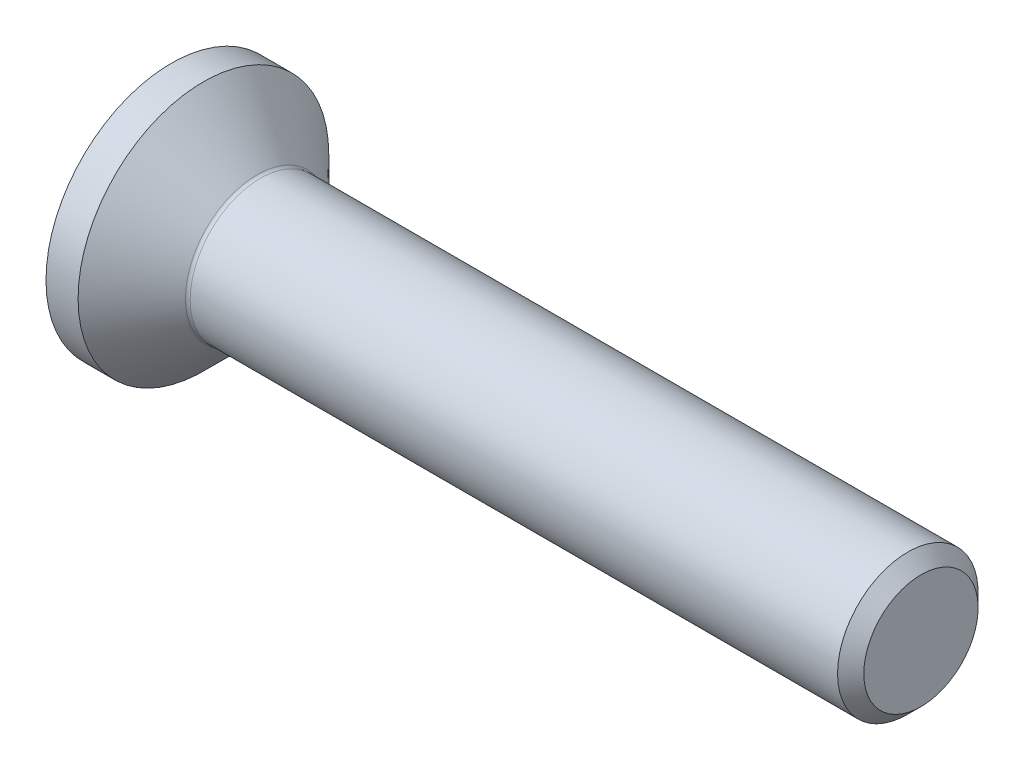
ISO-10303-21;
HEADER;
FILE_DESCRIPTION(('STEP AP214'),'2;1');
FILE_NAME('part.step','',(''),(''),'','','');
FILE_SCHEMA(('AUTOMOTIVE_DESIGN { 1 0 10303 214 1 1 1 1 }'));
ENDSEC;
DATA;
#1=APPLICATION_CONTEXT('core data for automotive mechanical design processes');
#2=APPLICATION_PROTOCOL_DEFINITION('international standard','automotive_design',2000,#1);
#3=PRODUCT_CONTEXT('',#1,'mechanical');
#4=PRODUCT('Part','Part','',(#3));
#5=PRODUCT_RELATED_PRODUCT_CATEGORY('part','',(#4));
#6=PRODUCT_DEFINITION_FORMATION('','',#4);
#7=PRODUCT_DEFINITION_CONTEXT('part definition',#1,'design');
#8=PRODUCT_DEFINITION('design','',#6,#7);
#9=PRODUCT_DEFINITION_SHAPE('','',#8);
#10=(LENGTH_UNIT() NAMED_UNIT(*) SI_UNIT(.MILLI.,.METRE.));
#11=(NAMED_UNIT(*) PLANE_ANGLE_UNIT() SI_UNIT($,.RADIAN.));
#12=(NAMED_UNIT(*) SI_UNIT($,.STERADIAN.) SOLID_ANGLE_UNIT());
#13=UNCERTAINTY_MEASURE_WITH_UNIT(LENGTH_MEASURE(1.E-05),#10,'distance_accuracy_value','');
#14=(GEOMETRIC_REPRESENTATION_CONTEXT(3) GLOBAL_UNCERTAINTY_ASSIGNED_CONTEXT((#13)) GLOBAL_UNIT_ASSIGNED_CONTEXT((#10,
#11,#12)) REPRESENTATION_CONTEXT('',''));
#15=CARTESIAN_POINT('',(0.,0.,0.));
#16=DIRECTION('',(0.,0.,1.));
#17=DIRECTION('',(1.,0.,0.));
#18=AXIS2_PLACEMENT_3D('',#15,#16,#17);
#19=CARTESIAN_POINT('',(0.,0.,0.));
#20=DIRECTION('',(-1.,0.,0.));
#21=DIRECTION('',(0.,0.,1.));
#22=AXIS2_PLACEMENT_3D('',#19,#20,#21);
#23=PLANE('',#22);
#24=CARTESIAN_POINT('',(0.,0.,0.));
#25=DIRECTION('',(-1.,0.,0.));
#26=DIRECTION('',(0.,0.,1.));
#27=AXIS2_PLACEMENT_3D('',#24,#25,#26);
#28=CIRCLE('',#27,2.675);
#29=CARTESIAN_POINT('',(0.,0.,2.675));
#30=VERTEX_POINT('',#29);
#31=EDGE_CURVE('E153',#30,#30,#28,.T.);
#32=ORIENTED_EDGE('',*,*,#31,.T.);
#33=EDGE_LOOP('',(#32));
#34=FACE_BOUND('',#33,.T.);
#35=DIRECTION('',(0.,-0.499999999999998,-0.86602540378444));
#36=VECTOR('',#35,1.);
#37=CARTESIAN_POINT('',(0.,-0.577350269189626,1.));
#38=LINE('',#37,#36);
#39=CARTESIAN_POINT('',(0.,-0.577350269189626,1.));
#40=VERTEX_POINT('',#39);
#41=CARTESIAN_POINT('',(0.,-1.15470053837925,0.));
#42=VERTEX_POINT('',#41);
#43=EDGE_CURVE('E119',#40,#42,#38,.T.);
#44=ORIENTED_EDGE('',*,*,#43,.T.);
#45=DIRECTION('',(0.,0.499999999999999,-0.866025403784439));
#46=VECTOR('',#45,1.);
#47=CARTESIAN_POINT('',(0.,-1.15470053837925,0.));
#48=LINE('',#47,#46);
#49=CARTESIAN_POINT('',(0.,-0.577350269189625,-1.));
#50=VERTEX_POINT('',#49);
#51=EDGE_CURVE('E50',#42,#50,#48,.T.);
#52=ORIENTED_EDGE('',*,*,#51,.T.);
#53=DIRECTION('',(0.,1.,0.));
#54=VECTOR('',#53,1.);
#55=CARTESIAN_POINT('',(0.,-0.577350269189625,-1.));
#56=LINE('',#55,#54);
#57=CARTESIAN_POINT('',(0.,0.577350269189626,-1.));
#58=VERTEX_POINT('',#57);
#59=EDGE_CURVE('E130',#50,#58,#56,.T.);
#60=ORIENTED_EDGE('',*,*,#59,.T.);
#61=DIRECTION('',(0.,0.5,0.866025403784439));
#62=VECTOR('',#61,1.);
#63=CARTESIAN_POINT('',(0.,0.577350269189626,-1.));
#64=LINE('',#63,#62);
#65=CARTESIAN_POINT('',(0.,1.15470053837925,0.));
#66=VERTEX_POINT('',#65);
#67=EDGE_CURVE('E254',#58,#66,#64,.T.);
#68=ORIENTED_EDGE('',*,*,#67,.T.);
#69=DIRECTION('',(0.,-0.499999999999999,0.866025403784439));
#70=VECTOR('',#69,1.);
#71=CARTESIAN_POINT('',(0.,1.15470053837925,0.));
#72=LINE('',#71,#70);
#73=CARTESIAN_POINT('',(0.,0.577350269189626,0.999999999999999));
#74=VERTEX_POINT('',#73);
#75=EDGE_CURVE('E257',#66,#74,#72,.T.);
#76=ORIENTED_EDGE('',*,*,#75,.T.);
#77=DIRECTION('',(0.,-1.,0.));
#78=VECTOR('',#77,1.);
#79=CARTESIAN_POINT('',(0.,0.577350269189626,0.999999999999999));
#80=LINE('',#79,#78);
#81=EDGE_CURVE('E260',#74,#40,#80,.T.);
#82=ORIENTED_EDGE('',*,*,#81,.T.);
#83=EDGE_LOOP('',(#44,#52,#60,#68,#76,#82));
#84=FACE_BOUND('',#83,.T.);
#85=ADVANCED_FACE('F35',(#34,#84),#23,.T.);
#86=CARTESIAN_POINT('',(0.,0.,0.));
#87=DIRECTION('',(-1.,0.,0.));
#88=DIRECTION('',(0.,0.,1.));
#89=AXIS2_PLACEMENT_3D('',#86,#87,#88);
#90=CYLINDRICAL_SURFACE('',#89,2.675);
#91=CARTESIAN_POINT('',(0.685000000000012,0.,0.));
#92=DIRECTION('',(-1.,0.,0.));
#93=DIRECTION('',(0.,0.,1.));
#94=AXIS2_PLACEMENT_3D('',#91,#92,#93);
#95=CIRCLE('',#94,2.675);
#96=CARTESIAN_POINT('',(0.685000000000012,0.,2.675));
#97=VERTEX_POINT('',#96);
#98=EDGE_CURVE('E150',#97,#97,#95,.T.);
#99=ORIENTED_EDGE('',*,*,#98,.T.);
#100=EDGE_LOOP('',(#99));
#101=FACE_BOUND('',#100,.T.);
#102=ORIENTED_EDGE('',*,*,#31,.F.);
#103=EDGE_LOOP('',(#102));
#104=FACE_BOUND('',#103,.T.);
#105=ADVANCED_FACE('F174',(#101,#104),#90,.T.);
#106=CARTESIAN_POINT('',(0.685000000000012,0.,0.));
#107=DIRECTION('',(-1.,0.,0.));
#108=DIRECTION('',(0.,0.,1.));
#109=AXIS2_PLACEMENT_3D('',#106,#107,#108);
#110=CONICAL_SURFACE('',#109,2.675,0.785398163397451);
#111=CARTESIAN_POINT('',(1.83071067811867,0.,0.));
#112=DIRECTION('',(-1.,0.,0.));
#113=DIRECTION('',(0.,0.,1.));
#114=AXIS2_PLACEMENT_3D('',#111,#112,#113);
#115=CIRCLE('',#114,1.52928932188133);
#116=CARTESIAN_POINT('',(1.83071067811867,0.,1.52928932188133));
#117=VERTEX_POINT('',#116);
#118=EDGE_CURVE('E43',#117,#117,#115,.T.);
#119=ORIENTED_EDGE('',*,*,#118,.T.);
#120=EDGE_LOOP('',(#119));
#121=FACE_BOUND('',#120,.T.);
#122=ORIENTED_EDGE('',*,*,#98,.F.);
#123=EDGE_LOOP('',(#122));
#124=FACE_BOUND('',#123,.T.);
#125=ADVANCED_FACE('F158',(#121,#124),#110,.T.);
#126=CARTESIAN_POINT('',(0.,0.,0.));
#127=DIRECTION('',(-1.,0.,0.));
#128=DIRECTION('',(0.,0.,1.));
#129=AXIS2_PLACEMENT_3D('',#126,#127,#128);
#130=CYLINDRICAL_SURFACE('',#129,1.49999999999999);
#131=CARTESIAN_POINT('',(1.90142135623733,0.,0.));
#132=DIRECTION('',(-1.,0.,0.));
#133=DIRECTION('',(0.,0.,1.));
#134=AXIS2_PLACEMENT_3D('',#131,#132,#133);
#135=CIRCLE('',#134,1.49999999999999);
#136=CARTESIAN_POINT('',(1.90142135623733,0.,1.49999999999999));
#137=VERTEX_POINT('',#136);
#138=EDGE_CURVE('E11',#137,#137,#135,.F.);
#139=ORIENTED_EDGE('',*,*,#138,.T.);
#140=EDGE_LOOP('',(#139));
#141=FACE_BOUND('',#140,.T.);
#142=CARTESIAN_POINT('',(15.7195,0.,0.));
#143=DIRECTION('',(-1.,0.,0.));
#144=DIRECTION('',(0.,0.,1.));
#145=AXIS2_PLACEMENT_3D('',#142,#143,#144);
#146=CIRCLE('',#145,1.49999999999997);
#147=CARTESIAN_POINT('',(15.7195,0.,1.49999999999997));
#148=VERTEX_POINT('',#147);
#149=EDGE_CURVE('E147',#148,#148,#146,.T.);
#150=ORIENTED_EDGE('',*,*,#149,.T.);
#151=EDGE_LOOP('',(#150));
#152=FACE_BOUND('',#151,.T.);
#153=ADVANCED_FACE('F185',(#141,#152),#130,.T.);
#154=CARTESIAN_POINT('',(16.,0.,0.));
#155=DIRECTION('',(-1.,0.,0.));
#156=DIRECTION('',(0.,0.,1.));
#157=AXIS2_PLACEMENT_3D('',#154,#155,#156);
#158=CONICAL_SURFACE('',#157,1.2195,0.785398163397368);
#159=ORIENTED_EDGE('',*,*,#149,.F.);
#160=EDGE_LOOP('',(#159));
#161=FACE_BOUND('',#160,.T.);
#162=CARTESIAN_POINT('',(16.,0.,0.));
#163=DIRECTION('',(-1.,0.,0.));
#164=DIRECTION('',(0.,0.,1.));
#165=AXIS2_PLACEMENT_3D('',#162,#163,#164);
#166=CIRCLE('',#165,1.2195);
#167=CARTESIAN_POINT('',(16.,0.,1.2195));
#168=VERTEX_POINT('',#167);
#169=EDGE_CURVE('E143',#168,#168,#166,.T.);
#170=ORIENTED_EDGE('',*,*,#169,.T.);
#171=EDGE_LOOP('',(#170));
#172=FACE_BOUND('',#171,.T.);
#173=ADVANCED_FACE('F169',(#161,#172),#158,.T.);
#174=CARTESIAN_POINT('',(16.,1.2195,0.));
#175=DIRECTION('',(1.,0.,0.));
#176=DIRECTION('',(0.,0.,-1.));
#177=AXIS2_PLACEMENT_3D('',#174,#175,#176);
#178=PLANE('',#177);
#179=ORIENTED_EDGE('',*,*,#169,.F.);
#180=EDGE_LOOP('',(#179));
#181=FACE_BOUND('',#180,.T.);
#182=ADVANCED_FACE('F162',(#181),#178,.T.);
#183=CARTESIAN_POINT('',(1.90142135623733,0.,0.));
#184=DIRECTION('',(-1.,0.,0.));
#185=DIRECTION('',(0.,0.,1.));
#186=AXIS2_PLACEMENT_3D('',#183,#184,#185);
#187=TOROIDAL_SURFACE('',#186,1.59999999999999,0.1);
#188=ORIENTED_EDGE('',*,*,#138,.F.);
#189=EDGE_LOOP('',(#188));
#190=FACE_BOUND('',#189,.T.);
#191=ORIENTED_EDGE('',*,*,#118,.F.);
#192=EDGE_LOOP('',(#191));
#193=FACE_BOUND('',#192,.T.);
#194=ADVANCED_FACE('F37',(#190,#193),#187,.F.);
#195=CARTESIAN_POINT('',(1.1,-1.15470053837925,0.));
#196=DIRECTION('',(0.,0.866025403784439,0.499999999999999));
#197=DIRECTION('',(0.,-0.499999999999999,0.866025403784439));
#198=AXIS2_PLACEMENT_3D('',#195,#196,#197);
#199=PLANE('',#198);
#200=ORIENTED_EDGE('',*,*,#51,.F.);
#201=DIRECTION('',(-1.,0.,0.));
#202=VECTOR('',#201,1.);
#203=CARTESIAN_POINT('',(1.1,-1.15470053837925,0.));
#204=LINE('',#203,#202);
#205=CARTESIAN_POINT('',(1.1,-1.15470053837925,0.));
#206=VERTEX_POINT('',#205);
#207=EDGE_CURVE('E251',#206,#42,#204,.T.);
#208=ORIENTED_EDGE('',*,*,#207,.F.);
#209=DIRECTION('',(0.,0.499999999999999,-0.866025403784439));
#210=VECTOR('',#209,1.);
#211=CARTESIAN_POINT('',(1.1,-1.15470053837925,0.));
#212=LINE('',#211,#210);
#213=CARTESIAN_POINT('',(1.1,-0.866025403784438,-0.499999999999998));
#214=VERTEX_POINT('',#213);
#215=EDGE_CURVE('E115',#206,#214,#212,.T.);
#216=ORIENTED_EDGE('',*,*,#215,.T.);
#217=CARTESIAN_POINT('',(1.1,-0.577350269189625,-1.));
#218=VERTEX_POINT('',#217);
#219=EDGE_CURVE('E111',#214,#218,#212,.T.);
#220=ORIENTED_EDGE('',*,*,#219,.T.);
#221=DIRECTION('',(-1.,0.,0.));
#222=VECTOR('',#221,1.);
#223=CARTESIAN_POINT('',(1.1,-0.577350269189625,-1.));
#224=LINE('',#223,#222);
#225=EDGE_CURVE('E113',#218,#50,#224,.T.);
#226=ORIENTED_EDGE('',*,*,#225,.T.);
#227=EDGE_LOOP('',(#200,#208,#216,#220,#226));
#228=FACE_BOUND('',#227,.T.);
#229=ADVANCED_FACE('F112',(#228),#199,.T.);
#230=CARTESIAN_POINT('',(1.1,-0.577350269189625,-1.));
#231=DIRECTION('',(0.,0.,1.));
#232=DIRECTION('',(1.,0.,0.));
#233=AXIS2_PLACEMENT_3D('',#230,#231,#232);
#234=PLANE('',#233);
#235=ORIENTED_EDGE('',*,*,#59,.F.);
#236=ORIENTED_EDGE('',*,*,#225,.F.);
#237=DIRECTION('',(0.,1.,0.));
#238=VECTOR('',#237,1.);
#239=CARTESIAN_POINT('',(1.1,-0.577350269189625,-1.));
#240=LINE('',#239,#238);
#241=CARTESIAN_POINT('',(1.1,0.,-1.));
#242=VERTEX_POINT('',#241);
#243=EDGE_CURVE('E58',#218,#242,#240,.T.);
#244=ORIENTED_EDGE('',*,*,#243,.T.);
#245=CARTESIAN_POINT('',(1.1,0.577350269189626,-1.));
#246=VERTEX_POINT('',#245);
#247=EDGE_CURVE('E125',#242,#246,#240,.T.);
#248=ORIENTED_EDGE('',*,*,#247,.T.);
#249=DIRECTION('',(-1.,0.,0.));
#250=VECTOR('',#249,1.);
#251=CARTESIAN_POINT('',(1.1,0.577350269189626,-1.));
#252=LINE('',#251,#250);
#253=EDGE_CURVE('E132',#246,#58,#252,.T.);
#254=ORIENTED_EDGE('',*,*,#253,.T.);
#255=EDGE_LOOP('',(#235,#236,#244,#248,#254));
#256=FACE_BOUND('',#255,.T.);
#257=ADVANCED_FACE('F127',(#256),#234,.T.);
#258=CARTESIAN_POINT('',(1.1,0.577350269189626,-1.));
#259=DIRECTION('',(0.,-0.866025403784438,0.5));
#260=DIRECTION('',(0.,-0.5,-0.866025403784439));
#261=AXIS2_PLACEMENT_3D('',#258,#259,#260);
#262=PLANE('',#261);
#263=ORIENTED_EDGE('',*,*,#67,.F.);
#264=ORIENTED_EDGE('',*,*,#253,.F.);
#265=DIRECTION('',(0.,0.5,0.866025403784439));
#266=VECTOR('',#265,1.);
#267=CARTESIAN_POINT('',(1.1,0.577350269189626,-1.));
#268=LINE('',#267,#266);
#269=CARTESIAN_POINT('',(1.1,0.866025403784439,-0.5));
#270=VERTEX_POINT('',#269);
#271=EDGE_CURVE('E232',#246,#270,#268,.T.);
#272=ORIENTED_EDGE('',*,*,#271,.T.);
#273=CARTESIAN_POINT('',(1.1,1.15470053837925,0.));
#274=VERTEX_POINT('',#273);
#275=EDGE_CURVE('E124',#270,#274,#268,.T.);
#276=ORIENTED_EDGE('',*,*,#275,.T.);
#277=DIRECTION('',(-1.,0.,0.));
#278=VECTOR('',#277,1.);
#279=CARTESIAN_POINT('',(1.1,1.15470053837925,0.));
#280=LINE('',#279,#278);
#281=EDGE_CURVE('E138',#274,#66,#280,.T.);
#282=ORIENTED_EDGE('',*,*,#281,.T.);
#283=EDGE_LOOP('',(#263,#264,#272,#276,#282));
#284=FACE_BOUND('',#283,.T.);
#285=ADVANCED_FACE('F199',(#284),#262,.T.);
#286=CARTESIAN_POINT('',(1.1,1.15470053837925,0.));
#287=DIRECTION('',(0.,-0.866025403784439,-0.499999999999999));
#288=DIRECTION('',(0.,0.499999999999999,-0.866025403784439));
#289=AXIS2_PLACEMENT_3D('',#286,#287,#288);
#290=PLANE('',#289);
#291=ORIENTED_EDGE('',*,*,#75,.F.);
#292=ORIENTED_EDGE('',*,*,#281,.F.);
#293=DIRECTION('',(0.,-0.499999999999999,0.866025403784439));
#294=VECTOR('',#293,1.);
#295=CARTESIAN_POINT('',(1.1,1.15470053837925,0.));
#296=LINE('',#295,#294);
#297=CARTESIAN_POINT('',(1.1,0.866025403784438,0.499999999999999));
#298=VERTEX_POINT('',#297);
#299=EDGE_CURVE('E239',#274,#298,#296,.T.);
#300=ORIENTED_EDGE('',*,*,#299,.T.);
#301=CARTESIAN_POINT('',(1.1,0.577350269189626,0.999999999999999));
#302=VERTEX_POINT('',#301);
#303=EDGE_CURVE('E237',#298,#302,#296,.T.);
#304=ORIENTED_EDGE('',*,*,#303,.T.);
#305=DIRECTION('',(-1.,0.,0.));
#306=VECTOR('',#305,1.);
#307=CARTESIAN_POINT('',(1.1,0.577350269189626,0.999999999999999));
#308=LINE('',#307,#306);
#309=EDGE_CURVE('E269',#302,#74,#308,.T.);
#310=ORIENTED_EDGE('',*,*,#309,.T.);
#311=EDGE_LOOP('',(#291,#292,#300,#304,#310));
#312=FACE_BOUND('',#311,.T.);
#313=ADVANCED_FACE('F202',(#312),#290,.T.);
#314=CARTESIAN_POINT('',(1.1,0.577350269189626,0.999999999999999));
#315=DIRECTION('',(0.,0.,-1.));
#316=DIRECTION('',(0.,1.,0.));
#317=AXIS2_PLACEMENT_3D('',#314,#315,#316);
#318=PLANE('',#317);
#319=ORIENTED_EDGE('',*,*,#81,.F.);
#320=ORIENTED_EDGE('',*,*,#309,.F.);
#321=DIRECTION('',(0.,-1.,0.));
#322=VECTOR('',#321,1.);
#323=CARTESIAN_POINT('',(1.1,0.577350269189626,0.999999999999999));
#324=LINE('',#323,#322);
#325=CARTESIAN_POINT('',(1.1,0.,1.));
#326=VERTEX_POINT('',#325);
#327=EDGE_CURVE('E244',#302,#326,#324,.T.);
#328=ORIENTED_EDGE('',*,*,#327,.T.);
#329=CARTESIAN_POINT('',(1.1,-0.577350269189626,1.));
#330=VERTEX_POINT('',#329);
#331=EDGE_CURVE('E243',#326,#330,#324,.T.);
#332=ORIENTED_EDGE('',*,*,#331,.T.);
#333=DIRECTION('',(-1.,0.,0.));
#334=VECTOR('',#333,1.);
#335=CARTESIAN_POINT('',(1.1,-0.577350269189626,1.));
#336=LINE('',#335,#334);
#337=EDGE_CURVE('E266',#330,#40,#336,.T.);
#338=ORIENTED_EDGE('',*,*,#337,.T.);
#339=EDGE_LOOP('',(#319,#320,#328,#332,#338));
#340=FACE_BOUND('',#339,.T.);
#341=ADVANCED_FACE('F206',(#340),#318,.T.);
#342=CARTESIAN_POINT('',(1.1,-0.577350269189626,1.));
#343=DIRECTION('',(0.,0.86602540378444,-0.499999999999998));
#344=DIRECTION('',(0.,0.499999999999998,0.86602540378444));
#345=AXIS2_PLACEMENT_3D('',#342,#343,#344);
#346=PLANE('',#345);
#347=ORIENTED_EDGE('',*,*,#43,.F.);
#348=ORIENTED_EDGE('',*,*,#337,.F.);
#349=DIRECTION('',(0.,-0.499999999999998,-0.86602540378444));
#350=VECTOR('',#349,1.);
#351=CARTESIAN_POINT('',(1.1,-0.577350269189626,1.));
#352=LINE('',#351,#350);
#353=CARTESIAN_POINT('',(1.1,-0.866025403784439,0.499999999999997));
#354=VERTEX_POINT('',#353);
#355=EDGE_CURVE('E248',#330,#354,#352,.T.);
#356=ORIENTED_EDGE('',*,*,#355,.T.);
#357=EDGE_CURVE('E247',#354,#206,#352,.T.);
#358=ORIENTED_EDGE('',*,*,#357,.T.);
#359=ORIENTED_EDGE('',*,*,#207,.T.);
#360=EDGE_LOOP('',(#347,#348,#356,#358,#359));
#361=FACE_BOUND('',#360,.T.);
#362=ADVANCED_FACE('F210',(#361),#346,.T.);
#363=CARTESIAN_POINT('',(1.1,-0.577350269189626,-1.));
#364=DIRECTION('',(1.,0.,0.));
#365=DIRECTION('',(0.,0.,-1.));
#366=AXIS2_PLACEMENT_3D('',#363,#364,#365);
#367=PLANE('',#366);
#368=ORIENTED_EDGE('',*,*,#243,.F.);
#369=ORIENTED_EDGE('',*,*,#219,.F.);
#370=CARTESIAN_POINT('',(1.1,0.,0.));
#371=DIRECTION('',(-1.,0.,0.));
#372=DIRECTION('',(0.,0.,1.));
#373=AXIS2_PLACEMENT_3D('',#370,#371,#372);
#374=CIRCLE('',#373,1.);
#375=EDGE_CURVE('E122',#242,#214,#374,.T.);
#376=ORIENTED_EDGE('',*,*,#375,.F.);
#377=EDGE_LOOP('',(#368,#369,#376));
#378=FACE_BOUND('',#377,.T.);
#379=ADVANCED_FACE('F121',(#378),#367,.F.);
#380=ORIENTED_EDGE('',*,*,#215,.F.);
#381=ORIENTED_EDGE('',*,*,#357,.F.);
#382=EDGE_CURVE('E135',#214,#354,#374,.T.);
#383=ORIENTED_EDGE('',*,*,#382,.F.);
#384=EDGE_LOOP('',(#380,#381,#383));
#385=FACE_BOUND('',#384,.T.);
#386=ADVANCED_FACE('F216',(#385),#367,.F.);
#387=ORIENTED_EDGE('',*,*,#355,.F.);
#388=ORIENTED_EDGE('',*,*,#331,.F.);
#389=EDGE_CURVE('E131',#354,#326,#374,.T.);
#390=ORIENTED_EDGE('',*,*,#389,.F.);
#391=EDGE_LOOP('',(#387,#388,#390));
#392=FACE_BOUND('',#391,.T.);
#393=ADVANCED_FACE('F220',(#392),#367,.F.);
#394=ORIENTED_EDGE('',*,*,#327,.F.);
#395=ORIENTED_EDGE('',*,*,#303,.F.);
#396=EDGE_CURVE('E137',#326,#298,#374,.T.);
#397=ORIENTED_EDGE('',*,*,#396,.F.);
#398=EDGE_LOOP('',(#394,#395,#397));
#399=FACE_BOUND('',#398,.T.);
#400=ADVANCED_FACE('F228',(#399),#367,.F.);
#401=ORIENTED_EDGE('',*,*,#299,.F.);
#402=ORIENTED_EDGE('',*,*,#275,.F.);
#403=EDGE_CURVE('E144',#298,#270,#374,.T.);
#404=ORIENTED_EDGE('',*,*,#403,.F.);
#405=EDGE_LOOP('',(#401,#402,#404));
#406=FACE_BOUND('',#405,.T.);
#407=ADVANCED_FACE('F223',(#406),#367,.F.);
#408=ORIENTED_EDGE('',*,*,#271,.F.);
#409=ORIENTED_EDGE('',*,*,#247,.F.);
#410=EDGE_CURVE('E233',#270,#242,#374,.T.);
#411=ORIENTED_EDGE('',*,*,#410,.F.);
#412=EDGE_LOOP('',(#408,#409,#411));
#413=FACE_BOUND('',#412,.T.);
#414=ADVANCED_FACE('F194',(#413),#367,.F.);
#415=CARTESIAN_POINT('',(1.1,0.,0.));
#416=DIRECTION('',(-1.,0.,0.));
#417=DIRECTION('',(0.,0.,1.));
#418=AXIS2_PLACEMENT_3D('',#415,#416,#417);
#419=CONICAL_SURFACE('',#418,1.,1.04719755119659);
#420=CARTESIAN_POINT('',(1.67735026918963,0.,0.));
#421=VERTEX_POINT('',#420);
#422=VERTEX_LOOP('',#421);
#423=FACE_BOUND('',#422,.T.);
#424=ORIENTED_EDGE('',*,*,#396,.T.);
#425=ORIENTED_EDGE('',*,*,#403,.T.);
#426=ORIENTED_EDGE('',*,*,#410,.T.);
#427=ORIENTED_EDGE('',*,*,#375,.T.);
#428=ORIENTED_EDGE('',*,*,#382,.T.);
#429=ORIENTED_EDGE('',*,*,#389,.T.);
#430=EDGE_LOOP('',(#424,#425,#426,#427,#428,#429));
#431=FACE_BOUND('',#430,.T.);
#432=ADVANCED_FACE('F192',(#423,#431),#419,.F.);
#433=CLOSED_SHELL('',(#85,#105,#125,#153,#173,#182,#194,#229,#257,#285,#313,#341,#362,#379,#386,
#393,#400,#407,#414,#432));
#434=MANIFOLD_SOLID_BREP('B2',#433);
#435=ADVANCED_BREP_SHAPE_REPRESENTATION('',(#18,#434),#14);
#436=SHAPE_DEFINITION_REPRESENTATION(#9,#435);
ENDSEC;
END-ISO-10303-21;
